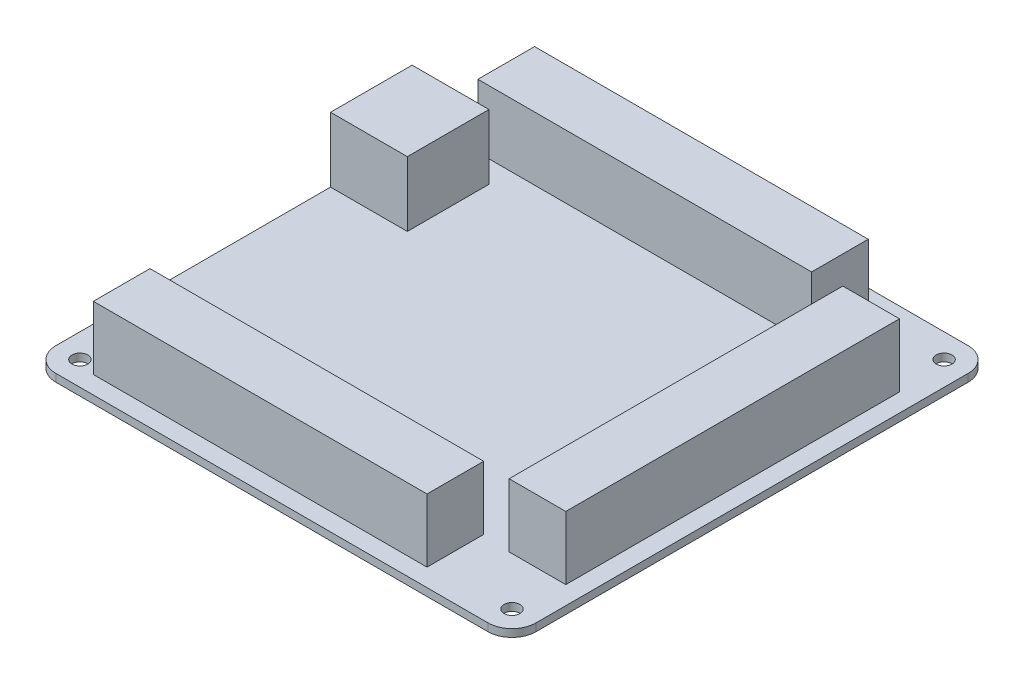
ISO-10303-21;
HEADER;
FILE_DESCRIPTION(('STEP AP214'),'2;1');
FILE_NAME('part.step','',(''),(''),'','','');
FILE_SCHEMA(('AUTOMOTIVE_DESIGN { 1 0 10303 214 1 1 1 1 }'));
ENDSEC;
DATA;
#1=APPLICATION_CONTEXT('core data for automotive mechanical design processes');
#2=APPLICATION_PROTOCOL_DEFINITION('international standard','automotive_design',2000,#1);
#3=PRODUCT_CONTEXT('',#1,'mechanical');
#4=PRODUCT('Part','Part','',(#3));
#5=PRODUCT_RELATED_PRODUCT_CATEGORY('part','',(#4));
#6=PRODUCT_DEFINITION_FORMATION('','',#4);
#7=PRODUCT_DEFINITION_CONTEXT('part definition',#1,'design');
#8=PRODUCT_DEFINITION('design','',#6,#7);
#9=PRODUCT_DEFINITION_SHAPE('','',#8);
#10=(LENGTH_UNIT() NAMED_UNIT(*) SI_UNIT(.MILLI.,.METRE.));
#11=(NAMED_UNIT(*) PLANE_ANGLE_UNIT() SI_UNIT($,.RADIAN.));
#12=(NAMED_UNIT(*) SI_UNIT($,.STERADIAN.) SOLID_ANGLE_UNIT());
#13=UNCERTAINTY_MEASURE_WITH_UNIT(LENGTH_MEASURE(1.E-05),#10,'distance_accuracy_value','');
#14=(GEOMETRIC_REPRESENTATION_CONTEXT(3) GLOBAL_UNCERTAINTY_ASSIGNED_CONTEXT((#13)) GLOBAL_UNIT_ASSIGNED_CONTEXT((#10,
#11,#12)) REPRESENTATION_CONTEXT('',''));
#15=CARTESIAN_POINT('',(0.,0.,0.));
#16=DIRECTION('',(0.,0.,1.));
#17=DIRECTION('',(1.,0.,0.));
#18=AXIS2_PLACEMENT_3D('',#15,#16,#17);
#19=CARTESIAN_POINT('',(0.,1.6,0.));
#20=DIRECTION('',(0.,-1.,0.));
#21=DIRECTION('',(0.,0.,-1.));
#22=AXIS2_PLACEMENT_3D('',#19,#20,#21);
#23=PLANE('',#22);
#24=DIRECTION('',(0.,0.,1.));
#25=VECTOR('',#24,1.);
#26=CARTESIAN_POINT('',(34.4,1.6,-34.5));
#27=LINE('',#26,#25);
#28=CARTESIAN_POINT('',(34.4,1.6,-34.5));
#29=VERTEX_POINT('',#28);
#30=CARTESIAN_POINT('',(34.4,1.6,35.));
#31=VERTEX_POINT('',#30);
#32=EDGE_CURVE('E216',#29,#31,#27,.T.);
#33=ORIENTED_EDGE('',*,*,#32,.F.);
#34=DIRECTION('',(-1.,0.,0.));
#35=VECTOR('',#34,1.);
#36=CARTESIAN_POINT('',(34.4,1.6,-34.5));
#37=LINE('',#36,#35);
#38=CARTESIAN_POINT('',(46.2,1.6,-34.5));
#39=VERTEX_POINT('',#38);
#40=EDGE_CURVE('E229',#39,#29,#37,.T.);
#41=ORIENTED_EDGE('',*,*,#40,.F.);
#42=DIRECTION('',(0.,0.,-1.));
#43=VECTOR('',#42,1.);
#44=CARTESIAN_POINT('',(46.2,1.6,-34.5));
#45=LINE('',#44,#43);
#46=CARTESIAN_POINT('',(46.2,1.6,35.));
#47=VERTEX_POINT('',#46);
#48=EDGE_CURVE('E238',#47,#39,#45,.T.);
#49=ORIENTED_EDGE('',*,*,#48,.F.);
#50=DIRECTION('',(1.,0.,0.));
#51=VECTOR('',#50,1.);
#52=CARTESIAN_POINT('',(34.4,1.6,35.));
#53=LINE('',#52,#51);
#54=EDGE_CURVE('E219',#31,#47,#53,.T.);
#55=ORIENTED_EDGE('',*,*,#54,.F.);
#56=EDGE_LOOP('',(#33,#41,#49,#55));
#57=FACE_BOUND('',#56,.T.);
#58=DIRECTION('',(-1.,0.,0.));
#59=VECTOR('',#58,1.);
#60=CARTESIAN_POINT('',(-50.,1.6,-29.2));
#61=LINE('',#60,#59);
#62=CARTESIAN_POINT('',(-34.,1.6,-29.2));
#63=VERTEX_POINT('',#62);
#64=CARTESIAN_POINT('',(-50.,1.6,-29.2));
#65=VERTEX_POINT('',#64);
#66=EDGE_CURVE('E292',#63,#65,#61,.T.);
#67=ORIENTED_EDGE('',*,*,#66,.F.);
#68=DIRECTION('',(0.,0.,-1.));
#69=VECTOR('',#68,1.);
#70=CARTESIAN_POINT('',(-34.,1.6,-29.2));
#71=LINE('',#70,#69);
#72=CARTESIAN_POINT('',(-34.,1.6,-12.2));
#73=VERTEX_POINT('',#72);
#74=EDGE_CURVE('E299',#73,#63,#71,.T.);
#75=ORIENTED_EDGE('',*,*,#74,.F.);
#76=DIRECTION('',(1.,0.,0.));
#77=VECTOR('',#76,1.);
#78=CARTESIAN_POINT('',(-34.,1.6,-12.2));
#79=LINE('',#78,#77);
#80=CARTESIAN_POINT('',(-50.,1.6,-12.2));
#81=VERTEX_POINT('',#80);
#82=EDGE_CURVE('E287',#81,#73,#79,.T.);
#83=ORIENTED_EDGE('',*,*,#82,.F.);
#84=DIRECTION('',(0.,0.,1.));
#85=VECTOR('',#84,1.);
#86=CARTESIAN_POINT('',(-50.,1.6,50.));
#87=LINE('',#86,#85);
#88=CARTESIAN_POINT('',(-50.,1.6,45.));
#89=VERTEX_POINT('',#88);
#90=EDGE_CURVE('E360',#81,#89,#87,.T.);
#91=ORIENTED_EDGE('',*,*,#90,.T.);
#92=CARTESIAN_POINT('',(-45.,1.6,45.));
#93=DIRECTION('',(0.,-1.,0.));
#94=DIRECTION('',(0.,0.,-1.));
#95=AXIS2_PLACEMENT_3D('',#92,#93,#94);
#96=CIRCLE('',#95,5.);
#97=CARTESIAN_POINT('',(-45.,1.6,50.));
#98=VERTEX_POINT('',#97);
#99=EDGE_CURVE('E384',#89,#98,#96,.F.);
#100=ORIENTED_EDGE('',*,*,#99,.T.);
#101=DIRECTION('',(1.,0.,0.));
#102=VECTOR('',#101,1.);
#103=CARTESIAN_POINT('',(-50.,1.6,50.));
#104=LINE('',#103,#102);
#105=CARTESIAN_POINT('',(45.,1.6,50.));
#106=VERTEX_POINT('',#105);
#107=EDGE_CURVE('E363',#98,#106,#104,.T.);
#108=ORIENTED_EDGE('',*,*,#107,.T.);
#109=CARTESIAN_POINT('',(45.,1.6,45.));
#110=DIRECTION('',(0.,-1.,0.));
#111=DIRECTION('',(0.,0.,-1.));
#112=AXIS2_PLACEMENT_3D('',#109,#110,#111);
#113=CIRCLE('',#112,5.);
#114=CARTESIAN_POINT('',(50.,1.6,45.));
#115=VERTEX_POINT('',#114);
#116=EDGE_CURVE('E382',#106,#115,#113,.F.);
#117=ORIENTED_EDGE('',*,*,#116,.T.);
#118=DIRECTION('',(0.,0.,-1.));
#119=VECTOR('',#118,1.);
#120=CARTESIAN_POINT('',(50.,1.6,50.));
#121=LINE('',#120,#119);
#122=CARTESIAN_POINT('',(50.,1.6,-45.));
#123=VERTEX_POINT('',#122);
#124=EDGE_CURVE('E353',#115,#123,#121,.T.);
#125=ORIENTED_EDGE('',*,*,#124,.T.);
#126=CARTESIAN_POINT('',(45.,1.6,-45.));
#127=DIRECTION('',(0.,-1.,0.));
#128=DIRECTION('',(0.,0.,-1.));
#129=AXIS2_PLACEMENT_3D('',#126,#127,#128);
#130=CIRCLE('',#129,5.);
#131=CARTESIAN_POINT('',(45.,1.6,-50.));
#132=VERTEX_POINT('',#131);
#133=EDGE_CURVE('E380',#123,#132,#130,.F.);
#134=ORIENTED_EDGE('',*,*,#133,.T.);
#135=DIRECTION('',(-1.,0.,0.));
#136=VECTOR('',#135,1.);
#137=CARTESIAN_POINT('',(-50.,1.6,-50.));
#138=LINE('',#137,#136);
#139=CARTESIAN_POINT('',(-45.,1.6,-50.));
#140=VERTEX_POINT('',#139);
#141=EDGE_CURVE('E356',#132,#140,#138,.T.);
#142=ORIENTED_EDGE('',*,*,#141,.T.);
#143=CARTESIAN_POINT('',(-45.,1.6,-45.));
#144=DIRECTION('',(0.,-1.,0.));
#145=DIRECTION('',(0.,0.,-1.));
#146=AXIS2_PLACEMENT_3D('',#143,#144,#145);
#147=CIRCLE('',#146,5.);
#148=CARTESIAN_POINT('',(-50.,1.6,-45.));
#149=VERTEX_POINT('',#148);
#150=EDGE_CURVE('E378',#140,#149,#147,.F.);
#151=ORIENTED_EDGE('',*,*,#150,.T.);
#152=EDGE_CURVE('E369',#149,#65,#87,.T.);
#153=ORIENTED_EDGE('',*,*,#152,.T.);
#154=EDGE_LOOP('',(#67,#75,#83,#91,#100,#108,#117,#125,#134,#142,#151,#153));
#155=FACE_BOUND('',#154,.T.);
#156=CARTESIAN_POINT('',(45.,1.6,45.));
#157=DIRECTION('',(0.,1.,0.));
#158=DIRECTION('',(0.,0.,1.));
#159=AXIS2_PLACEMENT_3D('',#156,#157,#158);
#160=CIRCLE('',#159,1.64999999999999);
#161=CARTESIAN_POINT('',(45.,1.6,46.65));
#162=VERTEX_POINT('',#161);
#163=EDGE_CURVE('E327',#162,#162,#160,.T.);
#164=ORIENTED_EDGE('',*,*,#163,.F.);
#165=EDGE_LOOP('',(#164));
#166=FACE_BOUND('',#165,.T.);
#167=CARTESIAN_POINT('',(-45.,1.6,45.));
#168=DIRECTION('',(0.,1.,0.));
#169=DIRECTION('',(0.,0.,1.));
#170=AXIS2_PLACEMENT_3D('',#167,#168,#169);
#171=CIRCLE('',#170,1.64999999999999);
#172=CARTESIAN_POINT('',(-45.,1.6,46.65));
#173=VERTEX_POINT('',#172);
#174=EDGE_CURVE('E334',#173,#173,#171,.T.);
#175=ORIENTED_EDGE('',*,*,#174,.F.);
#176=EDGE_LOOP('',(#175));
#177=FACE_BOUND('',#176,.T.);
#178=CARTESIAN_POINT('',(-45.,1.6,-45.));
#179=DIRECTION('',(0.,1.,0.));
#180=DIRECTION('',(0.,0.,1.));
#181=AXIS2_PLACEMENT_3D('',#178,#179,#180);
#182=CIRCLE('',#181,1.64999999999999);
#183=CARTESIAN_POINT('',(-45.,1.6,-43.35));
#184=VERTEX_POINT('',#183);
#185=EDGE_CURVE('E340',#184,#184,#182,.T.);
#186=ORIENTED_EDGE('',*,*,#185,.F.);
#187=EDGE_LOOP('',(#186));
#188=FACE_BOUND('',#187,.T.);
#189=CARTESIAN_POINT('',(45.,1.6,-45.));
#190=DIRECTION('',(0.,1.,0.));
#191=DIRECTION('',(0.,0.,1.));
#192=AXIS2_PLACEMENT_3D('',#189,#190,#191);
#193=CIRCLE('',#192,1.64999999999999);
#194=CARTESIAN_POINT('',(45.,1.6,-43.35));
#195=VERTEX_POINT('',#194);
#196=EDGE_CURVE('E346',#195,#195,#193,.T.);
#197=ORIENTED_EDGE('',*,*,#196,.F.);
#198=EDGE_LOOP('',(#197));
#199=FACE_BOUND('',#198,.T.);
#200=DIRECTION('',(0.,0.,1.));
#201=VECTOR('',#200,1.);
#202=CARTESIAN_POINT('',(-40.9,1.6,-45.6));
#203=LINE('',#202,#201);
#204=CARTESIAN_POINT('',(-40.9,1.6,-45.6));
#205=VERTEX_POINT('',#204);
#206=CARTESIAN_POINT('',(-40.9,1.6,-33.8));
#207=VERTEX_POINT('',#206);
#208=EDGE_CURVE('E254',#205,#207,#203,.T.);
#209=ORIENTED_EDGE('',*,*,#208,.F.);
#210=DIRECTION('',(-1.,0.,0.));
#211=VECTOR('',#210,1.);
#212=CARTESIAN_POINT('',(-40.9,1.6,-45.6));
#213=LINE('',#212,#211);
#214=CARTESIAN_POINT('',(28.6,1.6,-45.6));
#215=VERTEX_POINT('',#214);
#216=EDGE_CURVE('E259',#215,#205,#213,.T.);
#217=ORIENTED_EDGE('',*,*,#216,.F.);
#218=DIRECTION('',(0.,0.,-1.));
#219=VECTOR('',#218,1.);
#220=CARTESIAN_POINT('',(28.6,1.6,-45.6));
#221=LINE('',#220,#219);
#222=CARTESIAN_POINT('',(28.6,1.6,-33.8));
#223=VERTEX_POINT('',#222);
#224=EDGE_CURVE('E271',#223,#215,#221,.T.);
#225=ORIENTED_EDGE('',*,*,#224,.F.);
#226=DIRECTION('',(1.,0.,0.));
#227=VECTOR('',#226,1.);
#228=CARTESIAN_POINT('',(-40.9,1.6,-33.8));
#229=LINE('',#228,#227);
#230=EDGE_CURVE('E268',#207,#223,#229,.T.);
#231=ORIENTED_EDGE('',*,*,#230,.F.);
#232=EDGE_LOOP('',(#209,#217,#225,#231));
#233=FACE_BOUND('',#232,.T.);
#234=DIRECTION('',(0.,0.,1.));
#235=VECTOR('',#234,1.);
#236=CARTESIAN_POINT('',(-40.9,1.6,34.5));
#237=LINE('',#236,#235);
#238=CARTESIAN_POINT('',(-40.9,1.6,34.5));
#239=VERTEX_POINT('',#238);
#240=CARTESIAN_POINT('',(-40.9,1.6,46.3));
#241=VERTEX_POINT('',#240);
#242=EDGE_CURVE('E215',#239,#241,#237,.T.);
#243=ORIENTED_EDGE('',*,*,#242,.F.);
#244=DIRECTION('',(-1.,0.,0.));
#245=VECTOR('',#244,1.);
#246=CARTESIAN_POINT('',(-40.9,1.6,34.5));
#247=LINE('',#246,#245);
#248=CARTESIAN_POINT('',(28.6,1.6,34.5));
#249=VERTEX_POINT('',#248);
#250=EDGE_CURVE('E212',#249,#239,#247,.T.);
#251=ORIENTED_EDGE('',*,*,#250,.F.);
#252=DIRECTION('',(0.,0.,-1.));
#253=VECTOR('',#252,1.);
#254=CARTESIAN_POINT('',(28.6,1.6,34.5));
#255=LINE('',#254,#253);
#256=CARTESIAN_POINT('',(28.6,1.6,46.3));
#257=VERTEX_POINT('',#256);
#258=EDGE_CURVE('E55',#257,#249,#255,.T.);
#259=ORIENTED_EDGE('',*,*,#258,.F.);
#260=DIRECTION('',(1.,0.,0.));
#261=VECTOR('',#260,1.);
#262=CARTESIAN_POINT('',(-40.9,1.6,46.3));
#263=LINE('',#262,#261);
#264=EDGE_CURVE('E50',#241,#257,#263,.T.);
#265=ORIENTED_EDGE('',*,*,#264,.F.);
#266=EDGE_LOOP('',(#243,#251,#259,#265));
#267=FACE_BOUND('',#266,.T.);
#268=ADVANCED_FACE('F33',(#57,#155,#166,#177,#188,#199,#233,#267),#23,.F.);
#269=CARTESIAN_POINT('',(50.,1.6,50.));
#270=DIRECTION('',(-1.,0.,0.));
#271=DIRECTION('',(0.,0.,1.));
#272=AXIS2_PLACEMENT_3D('',#269,#270,#271);
#273=PLANE('',#272);
#274=DIRECTION('',(0.,0.,-1.));
#275=VECTOR('',#274,1.);
#276=CARTESIAN_POINT('',(50.,0.,50.));
#277=LINE('',#276,#275);
#278=CARTESIAN_POINT('',(50.,0.,45.));
#279=VERTEX_POINT('',#278);
#280=CARTESIAN_POINT('',(50.,0.,-45.));
#281=VERTEX_POINT('',#280);
#282=EDGE_CURVE('E352',#279,#281,#277,.T.);
#283=ORIENTED_EDGE('',*,*,#282,.T.);
#284=DIRECTION('',(0.,-1.,0.));
#285=VECTOR('',#284,1.);
#286=CARTESIAN_POINT('',(50.,1.6,-45.));
#287=LINE('',#286,#285);
#288=EDGE_CURVE('E373',#281,#123,#287,.F.);
#289=ORIENTED_EDGE('',*,*,#288,.T.);
#290=ORIENTED_EDGE('',*,*,#124,.F.);
#291=DIRECTION('',(0.,-1.,0.));
#292=VECTOR('',#291,1.);
#293=CARTESIAN_POINT('',(50.,1.6,45.));
#294=LINE('',#293,#292);
#295=EDGE_CURVE('E375',#115,#279,#294,.T.);
#296=ORIENTED_EDGE('',*,*,#295,.T.);
#297=EDGE_LOOP('',(#283,#289,#290,#296));
#298=FACE_BOUND('',#297,.T.);
#299=ADVANCED_FACE('F416',(#298),#273,.F.);
#300=CARTESIAN_POINT('',(-50.,1.6,-50.));
#301=DIRECTION('',(0.,0.,1.));
#302=DIRECTION('',(1.,0.,0.));
#303=AXIS2_PLACEMENT_3D('',#300,#301,#302);
#304=PLANE('',#303);
#305=DIRECTION('',(-1.,0.,0.));
#306=VECTOR('',#305,1.);
#307=CARTESIAN_POINT('',(-50.,0.,-50.));
#308=LINE('',#307,#306);
#309=CARTESIAN_POINT('',(45.,0.,-50.));
#310=VERTEX_POINT('',#309);
#311=CARTESIAN_POINT('',(-45.,0.,-50.));
#312=VERTEX_POINT('',#311);
#313=EDGE_CURVE('E410',#310,#312,#308,.T.);
#314=ORIENTED_EDGE('',*,*,#313,.T.);
#315=DIRECTION('',(0.,-1.,0.));
#316=VECTOR('',#315,1.);
#317=CARTESIAN_POINT('',(-45.,1.6,-50.));
#318=LINE('',#317,#316);
#319=EDGE_CURVE('E386',#312,#140,#318,.F.);
#320=ORIENTED_EDGE('',*,*,#319,.T.);
#321=ORIENTED_EDGE('',*,*,#141,.F.);
#322=DIRECTION('',(0.,-1.,0.));
#323=VECTOR('',#322,1.);
#324=CARTESIAN_POINT('',(45.,1.6,-50.));
#325=LINE('',#324,#323);
#326=EDGE_CURVE('E388',#132,#310,#325,.T.);
#327=ORIENTED_EDGE('',*,*,#326,.T.);
#328=EDGE_LOOP('',(#314,#320,#321,#327));
#329=FACE_BOUND('',#328,.T.);
#330=ADVANCED_FACE('F429',(#329),#304,.F.);
#331=CARTESIAN_POINT('',(-50.,1.6,50.));
#332=DIRECTION('',(1.,0.,0.));
#333=DIRECTION('',(0.,0.,-1.));
#334=AXIS2_PLACEMENT_3D('',#331,#332,#333);
#335=PLANE('',#334);
#336=ORIENTED_EDGE('',*,*,#152,.F.);
#337=DIRECTION('',(0.,-1.,0.));
#338=VECTOR('',#337,1.);
#339=CARTESIAN_POINT('',(-50.,1.6,-45.));
#340=LINE('',#339,#338);
#341=CARTESIAN_POINT('',(-50.,0.,-45.));
#342=VERTEX_POINT('',#341);
#343=EDGE_CURVE('E399',#149,#342,#340,.T.);
#344=ORIENTED_EDGE('',*,*,#343,.T.);
#345=DIRECTION('',(0.,0.,1.));
#346=VECTOR('',#345,1.);
#347=CARTESIAN_POINT('',(-50.,0.,50.));
#348=LINE('',#347,#346);
#349=CARTESIAN_POINT('',(-50.,0.,45.));
#350=VERTEX_POINT('',#349);
#351=EDGE_CURVE('E407',#342,#350,#348,.T.);
#352=ORIENTED_EDGE('',*,*,#351,.T.);
#353=DIRECTION('',(0.,-1.,0.));
#354=VECTOR('',#353,1.);
#355=CARTESIAN_POINT('',(-50.,1.6,45.));
#356=LINE('',#355,#354);
#357=EDGE_CURVE('E402',#350,#89,#356,.F.);
#358=ORIENTED_EDGE('',*,*,#357,.T.);
#359=ORIENTED_EDGE('',*,*,#90,.F.);
#360=DIRECTION('',(0.,-1.,0.));
#361=VECTOR('',#360,1.);
#362=CARTESIAN_POINT('',(-50.,15.1,-12.2));
#363=LINE('',#362,#361);
#364=CARTESIAN_POINT('',(-50.,15.1,-12.2));
#365=VERTEX_POINT('',#364);
#366=EDGE_CURVE('E322',#365,#81,#363,.T.);
#367=ORIENTED_EDGE('',*,*,#366,.F.);
#368=DIRECTION('',(0.,0.,1.));
#369=VECTOR('',#368,1.);
#370=CARTESIAN_POINT('',(-50.,15.1,-29.2));
#371=LINE('',#370,#369);
#372=CARTESIAN_POINT('',(-50.,15.1,-29.2));
#373=VERTEX_POINT('',#372);
#374=EDGE_CURVE('E288',#373,#365,#371,.T.);
#375=ORIENTED_EDGE('',*,*,#374,.F.);
#376=DIRECTION('',(0.,-1.,0.));
#377=VECTOR('',#376,1.);
#378=CARTESIAN_POINT('',(-50.,15.1,-29.2));
#379=LINE('',#378,#377);
#380=EDGE_CURVE('E298',#373,#65,#379,.T.);
#381=ORIENTED_EDGE('',*,*,#380,.T.);
#382=EDGE_LOOP('',(#336,#344,#352,#358,#359,#367,#375,#381));
#383=FACE_BOUND('',#382,.T.);
#384=ADVANCED_FACE('F435',(#383),#335,.F.);
#385=CARTESIAN_POINT('',(-50.,1.6,50.));
#386=DIRECTION('',(0.,0.,-1.));
#387=DIRECTION('',(-1.,0.,0.));
#388=AXIS2_PLACEMENT_3D('',#385,#386,#387);
#389=PLANE('',#388);
#390=DIRECTION('',(1.,0.,0.));
#391=VECTOR('',#390,1.);
#392=CARTESIAN_POINT('',(-50.,0.,50.));
#393=LINE('',#392,#391);
#394=CARTESIAN_POINT('',(-45.,0.,50.));
#395=VERTEX_POINT('',#394);
#396=CARTESIAN_POINT('',(45.,0.,50.));
#397=VERTEX_POINT('',#396);
#398=EDGE_CURVE('E357',#395,#397,#393,.T.);
#399=ORIENTED_EDGE('',*,*,#398,.T.);
#400=DIRECTION('',(0.,-1.,0.));
#401=VECTOR('',#400,1.);
#402=CARTESIAN_POINT('',(45.,1.6,50.));
#403=LINE('',#402,#401);
#404=EDGE_CURVE('E11',#397,#106,#403,.F.);
#405=ORIENTED_EDGE('',*,*,#404,.T.);
#406=ORIENTED_EDGE('',*,*,#107,.F.);
#407=DIRECTION('',(0.,-1.,0.));
#408=VECTOR('',#407,1.);
#409=CARTESIAN_POINT('',(-45.,1.6,50.));
#410=LINE('',#409,#408);
#411=EDGE_CURVE('E42',#98,#395,#410,.T.);
#412=ORIENTED_EDGE('',*,*,#411,.T.);
#413=EDGE_LOOP('',(#399,#405,#406,#412));
#414=FACE_BOUND('',#413,.T.);
#415=ADVANCED_FACE('F445',(#414),#389,.F.);
#416=CARTESIAN_POINT('',(0.,0.,0.));
#417=DIRECTION('',(0.,-1.,0.));
#418=DIRECTION('',(0.,0.,-1.));
#419=AXIS2_PLACEMENT_3D('',#416,#417,#418);
#420=PLANE('',#419);
#421=CARTESIAN_POINT('',(45.,0.,45.));
#422=DIRECTION('',(0.,1.,0.));
#423=DIRECTION('',(0.,0.,1.));
#424=AXIS2_PLACEMENT_3D('',#421,#422,#423);
#425=CIRCLE('',#424,1.64999999999999);
#426=CARTESIAN_POINT('',(45.,0.,46.65));
#427=VERTEX_POINT('',#426);
#428=EDGE_CURVE('E331',#427,#427,#425,.T.);
#429=ORIENTED_EDGE('',*,*,#428,.T.);
#430=EDGE_LOOP('',(#429));
#431=FACE_BOUND('',#430,.T.);
#432=CARTESIAN_POINT('',(-45.,0.,45.));
#433=DIRECTION('',(0.,1.,0.));
#434=DIRECTION('',(0.,0.,1.));
#435=AXIS2_PLACEMENT_3D('',#432,#433,#434);
#436=CIRCLE('',#435,1.64999999999999);
#437=CARTESIAN_POINT('',(-45.,0.,46.65));
#438=VERTEX_POINT('',#437);
#439=EDGE_CURVE('E337',#438,#438,#436,.T.);
#440=ORIENTED_EDGE('',*,*,#439,.T.);
#441=EDGE_LOOP('',(#440));
#442=FACE_BOUND('',#441,.T.);
#443=CARTESIAN_POINT('',(-45.,0.,-45.));
#444=DIRECTION('',(0.,1.,0.));
#445=DIRECTION('',(0.,0.,1.));
#446=AXIS2_PLACEMENT_3D('',#443,#444,#445);
#447=CIRCLE('',#446,1.64999999999999);
#448=CARTESIAN_POINT('',(-45.,0.,-43.35));
#449=VERTEX_POINT('',#448);
#450=EDGE_CURVE('E343',#449,#449,#447,.T.);
#451=ORIENTED_EDGE('',*,*,#450,.T.);
#452=EDGE_LOOP('',(#451));
#453=FACE_BOUND('',#452,.T.);
#454=CARTESIAN_POINT('',(45.,0.,-45.));
#455=DIRECTION('',(0.,1.,0.));
#456=DIRECTION('',(0.,0.,1.));
#457=AXIS2_PLACEMENT_3D('',#454,#455,#456);
#458=CIRCLE('',#457,1.64999999999999);
#459=CARTESIAN_POINT('',(45.,0.,-43.35));
#460=VERTEX_POINT('',#459);
#461=EDGE_CURVE('E349',#460,#460,#458,.T.);
#462=ORIENTED_EDGE('',*,*,#461,.T.);
#463=EDGE_LOOP('',(#462));
#464=FACE_BOUND('',#463,.T.);
#465=ORIENTED_EDGE('',*,*,#351,.F.);
#466=CARTESIAN_POINT('',(-45.,0.,-45.));
#467=DIRECTION('',(0.,-1.,0.));
#468=DIRECTION('',(0.,0.,-1.));
#469=AXIS2_PLACEMENT_3D('',#466,#467,#468);
#470=CIRCLE('',#469,5.);
#471=EDGE_CURVE('E391',#342,#312,#470,.T.);
#472=ORIENTED_EDGE('',*,*,#471,.T.);
#473=ORIENTED_EDGE('',*,*,#313,.F.);
#474=CARTESIAN_POINT('',(45.,0.,-45.));
#475=DIRECTION('',(0.,-1.,0.));
#476=DIRECTION('',(0.,0.,-1.));
#477=AXIS2_PLACEMENT_3D('',#474,#475,#476);
#478=CIRCLE('',#477,5.);
#479=EDGE_CURVE('E393',#310,#281,#478,.T.);
#480=ORIENTED_EDGE('',*,*,#479,.T.);
#481=ORIENTED_EDGE('',*,*,#282,.F.);
#482=CARTESIAN_POINT('',(45.,0.,45.));
#483=DIRECTION('',(0.,-1.,0.));
#484=DIRECTION('',(0.,0.,-1.));
#485=AXIS2_PLACEMENT_3D('',#482,#483,#484);
#486=CIRCLE('',#485,5.);
#487=EDGE_CURVE('E395',#279,#397,#486,.T.);
#488=ORIENTED_EDGE('',*,*,#487,.T.);
#489=ORIENTED_EDGE('',*,*,#398,.F.);
#490=CARTESIAN_POINT('',(-45.,0.,45.));
#491=DIRECTION('',(0.,-1.,0.));
#492=DIRECTION('',(0.,0.,-1.));
#493=AXIS2_PLACEMENT_3D('',#490,#491,#492);
#494=CIRCLE('',#493,5.);
#495=EDGE_CURVE('E397',#395,#350,#494,.T.);
#496=ORIENTED_EDGE('',*,*,#495,.T.);
#497=EDGE_LOOP('',(#465,#472,#473,#480,#481,#488,#489,#496));
#498=FACE_BOUND('',#497,.T.);
#499=ADVANCED_FACE('F438',(#431,#442,#453,#464,#498),#420,.T.);
#500=CARTESIAN_POINT('',(-45.,1.6,-45.));
#501=DIRECTION('',(0.,-1.,0.));
#502=DIRECTION('',(0.,0.,-1.));
#503=AXIS2_PLACEMENT_3D('',#500,#501,#502);
#504=CYLINDRICAL_SURFACE('',#503,5.);
#505=ORIENTED_EDGE('',*,*,#150,.F.);
#506=ORIENTED_EDGE('',*,*,#319,.F.);
#507=ORIENTED_EDGE('',*,*,#471,.F.);
#508=ORIENTED_EDGE('',*,*,#343,.F.);
#509=EDGE_LOOP('',(#505,#506,#507,#508));
#510=FACE_BOUND('',#509,.T.);
#511=ADVANCED_FACE('F433',(#510),#504,.T.);
#512=CARTESIAN_POINT('',(45.,1.6,-45.));
#513=DIRECTION('',(0.,-1.,0.));
#514=DIRECTION('',(0.,0.,-1.));
#515=AXIS2_PLACEMENT_3D('',#512,#513,#514);
#516=CYLINDRICAL_SURFACE('',#515,5.);
#517=ORIENTED_EDGE('',*,*,#133,.F.);
#518=ORIENTED_EDGE('',*,*,#288,.F.);
#519=ORIENTED_EDGE('',*,*,#479,.F.);
#520=ORIENTED_EDGE('',*,*,#326,.F.);
#521=EDGE_LOOP('',(#517,#518,#519,#520));
#522=FACE_BOUND('',#521,.T.);
#523=ADVANCED_FACE('F422',(#522),#516,.T.);
#524=CARTESIAN_POINT('',(45.,1.6,45.));
#525=DIRECTION('',(0.,-1.,0.));
#526=DIRECTION('',(0.,0.,-1.));
#527=AXIS2_PLACEMENT_3D('',#524,#525,#526);
#528=CYLINDRICAL_SURFACE('',#527,5.);
#529=ORIENTED_EDGE('',*,*,#116,.F.);
#530=ORIENTED_EDGE('',*,*,#404,.F.);
#531=ORIENTED_EDGE('',*,*,#487,.F.);
#532=ORIENTED_EDGE('',*,*,#295,.F.);
#533=EDGE_LOOP('',(#529,#530,#531,#532));
#534=FACE_BOUND('',#533,.T.);
#535=ADVANCED_FACE('F450',(#534),#528,.T.);
#536=CARTESIAN_POINT('',(-45.,1.6,45.));
#537=DIRECTION('',(0.,-1.,0.));
#538=DIRECTION('',(0.,0.,-1.));
#539=AXIS2_PLACEMENT_3D('',#536,#537,#538);
#540=CYLINDRICAL_SURFACE('',#539,5.);
#541=ORIENTED_EDGE('',*,*,#99,.F.);
#542=ORIENTED_EDGE('',*,*,#357,.F.);
#543=ORIENTED_EDGE('',*,*,#495,.F.);
#544=ORIENTED_EDGE('',*,*,#411,.F.);
#545=EDGE_LOOP('',(#541,#542,#543,#544));
#546=FACE_BOUND('',#545,.T.);
#547=ADVANCED_FACE('F35',(#546),#540,.T.);
#548=CARTESIAN_POINT('',(45.,1.6,-45.));
#549=DIRECTION('',(0.,1.,0.));
#550=DIRECTION('',(0.,0.,1.));
#551=AXIS2_PLACEMENT_3D('',#548,#549,#550);
#552=CYLINDRICAL_SURFACE('',#551,1.64999999999999);
#553=ORIENTED_EDGE('',*,*,#461,.F.);
#554=EDGE_LOOP('',(#553));
#555=FACE_BOUND('',#554,.T.);
#556=ORIENTED_EDGE('',*,*,#196,.T.);
#557=EDGE_LOOP('',(#556));
#558=FACE_BOUND('',#557,.T.);
#559=ADVANCED_FACE('F456',(#555,#558),#552,.F.);
#560=CARTESIAN_POINT('',(-45.,1.6,-45.));
#561=DIRECTION('',(0.,1.,0.));
#562=DIRECTION('',(0.,0.,1.));
#563=AXIS2_PLACEMENT_3D('',#560,#561,#562);
#564=CYLINDRICAL_SURFACE('',#563,1.64999999999999);
#565=ORIENTED_EDGE('',*,*,#450,.F.);
#566=EDGE_LOOP('',(#565));
#567=FACE_BOUND('',#566,.T.);
#568=ORIENTED_EDGE('',*,*,#185,.T.);
#569=EDGE_LOOP('',(#568));
#570=FACE_BOUND('',#569,.T.);
#571=ADVANCED_FACE('F511',(#567,#570),#564,.F.);
#572=CARTESIAN_POINT('',(-45.,1.6,45.));
#573=DIRECTION('',(0.,1.,0.));
#574=DIRECTION('',(0.,0.,1.));
#575=AXIS2_PLACEMENT_3D('',#572,#573,#574);
#576=CYLINDRICAL_SURFACE('',#575,1.64999999999999);
#577=ORIENTED_EDGE('',*,*,#439,.F.);
#578=EDGE_LOOP('',(#577));
#579=FACE_BOUND('',#578,.T.);
#580=ORIENTED_EDGE('',*,*,#174,.T.);
#581=EDGE_LOOP('',(#580));
#582=FACE_BOUND('',#581,.T.);
#583=ADVANCED_FACE('F520',(#579,#582),#576,.F.);
#584=CARTESIAN_POINT('',(45.,1.6,45.));
#585=DIRECTION('',(0.,1.,0.));
#586=DIRECTION('',(0.,0.,1.));
#587=AXIS2_PLACEMENT_3D('',#584,#585,#586);
#588=CYLINDRICAL_SURFACE('',#587,1.64999999999999);
#589=ORIENTED_EDGE('',*,*,#428,.F.);
#590=EDGE_LOOP('',(#589));
#591=FACE_BOUND('',#590,.T.);
#592=ORIENTED_EDGE('',*,*,#163,.T.);
#593=EDGE_LOOP('',(#592));
#594=FACE_BOUND('',#593,.T.);
#595=ADVANCED_FACE('F529',(#591,#594),#588,.F.);
#596=CARTESIAN_POINT('',(-34.,15.1,-12.2));
#597=DIRECTION('',(0.,0.,-1.));
#598=DIRECTION('',(-1.,0.,0.));
#599=AXIS2_PLACEMENT_3D('',#596,#597,#598);
#600=PLANE('',#599);
#601=ORIENTED_EDGE('',*,*,#82,.T.);
#602=DIRECTION('',(0.,-1.,0.));
#603=VECTOR('',#602,1.);
#604=CARTESIAN_POINT('',(-34.,15.1,-12.2));
#605=LINE('',#604,#603);
#606=CARTESIAN_POINT('',(-34.,15.1,-12.2));
#607=VERTEX_POINT('',#606);
#608=EDGE_CURVE('E317',#607,#73,#605,.T.);
#609=ORIENTED_EDGE('',*,*,#608,.F.);
#610=DIRECTION('',(1.,0.,0.));
#611=VECTOR('',#610,1.);
#612=CARTESIAN_POINT('',(-34.,15.1,-12.2));
#613=LINE('',#612,#611);
#614=EDGE_CURVE('E291',#365,#607,#613,.T.);
#615=ORIENTED_EDGE('',*,*,#614,.F.);
#616=ORIENTED_EDGE('',*,*,#366,.T.);
#617=EDGE_LOOP('',(#601,#609,#615,#616));
#618=FACE_BOUND('',#617,.T.);
#619=ADVANCED_FACE('F539',(#618),#600,.F.);
#620=CARTESIAN_POINT('',(-34.,15.1,-29.2));
#621=DIRECTION('',(-1.,0.,0.));
#622=DIRECTION('',(0.,0.,1.));
#623=AXIS2_PLACEMENT_3D('',#620,#621,#622);
#624=PLANE('',#623);
#625=ORIENTED_EDGE('',*,*,#74,.T.);
#626=DIRECTION('',(0.,-1.,0.));
#627=VECTOR('',#626,1.);
#628=CARTESIAN_POINT('',(-34.,15.1,-29.2));
#629=LINE('',#628,#627);
#630=CARTESIAN_POINT('',(-34.,15.1,-29.2));
#631=VERTEX_POINT('',#630);
#632=EDGE_CURVE('E304',#631,#63,#629,.T.);
#633=ORIENTED_EDGE('',*,*,#632,.F.);
#634=DIRECTION('',(0.,0.,-1.));
#635=VECTOR('',#634,1.);
#636=CARTESIAN_POINT('',(-34.,15.1,-29.2));
#637=LINE('',#636,#635);
#638=EDGE_CURVE('E294',#607,#631,#637,.T.);
#639=ORIENTED_EDGE('',*,*,#638,.F.);
#640=ORIENTED_EDGE('',*,*,#608,.T.);
#641=EDGE_LOOP('',(#625,#633,#639,#640));
#642=FACE_BOUND('',#641,.T.);
#643=ADVANCED_FACE('F556',(#642),#624,.F.);
#644=CARTESIAN_POINT('',(-50.,15.1,-29.2));
#645=DIRECTION('',(0.,0.,1.));
#646=DIRECTION('',(1.,0.,0.));
#647=AXIS2_PLACEMENT_3D('',#644,#645,#646);
#648=PLANE('',#647);
#649=ORIENTED_EDGE('',*,*,#66,.T.);
#650=ORIENTED_EDGE('',*,*,#380,.F.);
#651=DIRECTION('',(-1.,0.,0.));
#652=VECTOR('',#651,1.);
#653=CARTESIAN_POINT('',(-50.,15.1,-29.2));
#654=LINE('',#653,#652);
#655=EDGE_CURVE('E296',#631,#373,#654,.T.);
#656=ORIENTED_EDGE('',*,*,#655,.F.);
#657=ORIENTED_EDGE('',*,*,#632,.T.);
#658=EDGE_LOOP('',(#649,#650,#656,#657));
#659=FACE_BOUND('',#658,.T.);
#660=ADVANCED_FACE('F566',(#659),#648,.F.);
#661=CARTESIAN_POINT('',(0.,15.1,0.));
#662=DIRECTION('',(0.,-1.,0.));
#663=DIRECTION('',(0.,0.,-1.));
#664=AXIS2_PLACEMENT_3D('',#661,#662,#663);
#665=PLANE('',#664);
#666=ORIENTED_EDGE('',*,*,#374,.T.);
#667=ORIENTED_EDGE('',*,*,#614,.T.);
#668=ORIENTED_EDGE('',*,*,#638,.T.);
#669=ORIENTED_EDGE('',*,*,#655,.T.);
#670=EDGE_LOOP('',(#666,#667,#668,#669));
#671=FACE_BOUND('',#670,.T.);
#672=ADVANCED_FACE('F575',(#671),#665,.F.);
#673=CARTESIAN_POINT('',(-40.9,14.8,-45.6));
#674=DIRECTION('',(1.,0.,0.));
#675=DIRECTION('',(0.,0.,-1.));
#676=AXIS2_PLACEMENT_3D('',#673,#674,#675);
#677=PLANE('',#676);
#678=ORIENTED_EDGE('',*,*,#208,.T.);
#679=DIRECTION('',(0.,-1.,0.));
#680=VECTOR('',#679,1.);
#681=CARTESIAN_POINT('',(-40.9,14.8,-33.8));
#682=LINE('',#681,#680);
#683=CARTESIAN_POINT('',(-40.9,14.8,-33.8));
#684=VERTEX_POINT('',#683);
#685=EDGE_CURVE('E284',#684,#207,#682,.T.);
#686=ORIENTED_EDGE('',*,*,#685,.F.);
#687=DIRECTION('',(0.,0.,1.));
#688=VECTOR('',#687,1.);
#689=CARTESIAN_POINT('',(-40.9,14.8,-45.6));
#690=LINE('',#689,#688);
#691=CARTESIAN_POINT('',(-40.9,14.8,-45.6));
#692=VERTEX_POINT('',#691);
#693=EDGE_CURVE('E255',#692,#684,#690,.T.);
#694=ORIENTED_EDGE('',*,*,#693,.F.);
#695=DIRECTION('',(0.,-1.,0.));
#696=VECTOR('',#695,1.);
#697=CARTESIAN_POINT('',(-40.9,14.8,-45.6));
#698=LINE('',#697,#696);
#699=EDGE_CURVE('E265',#692,#205,#698,.T.);
#700=ORIENTED_EDGE('',*,*,#699,.T.);
#701=EDGE_LOOP('',(#678,#686,#694,#700));
#702=FACE_BOUND('',#701,.T.);
#703=ADVANCED_FACE('F583',(#702),#677,.F.);
#704=CARTESIAN_POINT('',(-40.9,14.8,-33.8));
#705=DIRECTION('',(0.,0.,-1.));
#706=DIRECTION('',(-1.,0.,0.));
#707=AXIS2_PLACEMENT_3D('',#704,#705,#706);
#708=PLANE('',#707);
#709=ORIENTED_EDGE('',*,*,#230,.T.);
#710=DIRECTION('',(0.,-1.,0.));
#711=VECTOR('',#710,1.);
#712=CARTESIAN_POINT('',(28.6,14.8,-33.8));
#713=LINE('',#712,#711);
#714=CARTESIAN_POINT('',(28.6,14.8,-33.8));
#715=VERTEX_POINT('',#714);
#716=EDGE_CURVE('E281',#715,#223,#713,.T.);
#717=ORIENTED_EDGE('',*,*,#716,.F.);
#718=DIRECTION('',(1.,0.,0.));
#719=VECTOR('',#718,1.);
#720=CARTESIAN_POINT('',(-40.9,14.8,-33.8));
#721=LINE('',#720,#719);
#722=EDGE_CURVE('E258',#684,#715,#721,.T.);
#723=ORIENTED_EDGE('',*,*,#722,.F.);
#724=ORIENTED_EDGE('',*,*,#685,.T.);
#725=EDGE_LOOP('',(#709,#717,#723,#724));
#726=FACE_BOUND('',#725,.T.);
#727=ADVANCED_FACE('F598',(#726),#708,.F.);
#728=CARTESIAN_POINT('',(28.6,14.8,-45.6));
#729=DIRECTION('',(-1.,0.,0.));
#730=DIRECTION('',(0.,0.,1.));
#731=AXIS2_PLACEMENT_3D('',#728,#729,#730);
#732=PLANE('',#731);
#733=ORIENTED_EDGE('',*,*,#224,.T.);
#734=DIRECTION('',(0.,-1.,0.));
#735=VECTOR('',#734,1.);
#736=CARTESIAN_POINT('',(28.6,14.8,-45.6));
#737=LINE('',#736,#735);
#738=CARTESIAN_POINT('',(28.6,14.8,-45.6));
#739=VERTEX_POINT('',#738);
#740=EDGE_CURVE('E278',#739,#215,#737,.T.);
#741=ORIENTED_EDGE('',*,*,#740,.F.);
#742=DIRECTION('',(0.,0.,-1.));
#743=VECTOR('',#742,1.);
#744=CARTESIAN_POINT('',(28.6,14.8,-45.6));
#745=LINE('',#744,#743);
#746=EDGE_CURVE('E261',#715,#739,#745,.T.);
#747=ORIENTED_EDGE('',*,*,#746,.F.);
#748=ORIENTED_EDGE('',*,*,#716,.T.);
#749=EDGE_LOOP('',(#733,#741,#747,#748));
#750=FACE_BOUND('',#749,.T.);
#751=ADVANCED_FACE('F608',(#750),#732,.F.);
#752=CARTESIAN_POINT('',(-40.9,14.8,-45.6));
#753=DIRECTION('',(0.,0.,1.));
#754=DIRECTION('',(1.,0.,0.));
#755=AXIS2_PLACEMENT_3D('',#752,#753,#754);
#756=PLANE('',#755);
#757=ORIENTED_EDGE('',*,*,#216,.T.);
#758=ORIENTED_EDGE('',*,*,#699,.F.);
#759=DIRECTION('',(-1.,0.,0.));
#760=VECTOR('',#759,1.);
#761=CARTESIAN_POINT('',(-40.9,14.8,-45.6));
#762=LINE('',#761,#760);
#763=EDGE_CURVE('E263',#739,#692,#762,.T.);
#764=ORIENTED_EDGE('',*,*,#763,.F.);
#765=ORIENTED_EDGE('',*,*,#740,.T.);
#766=EDGE_LOOP('',(#757,#758,#764,#765));
#767=FACE_BOUND('',#766,.T.);
#768=ADVANCED_FACE('F618',(#767),#756,.F.);
#769=CARTESIAN_POINT('',(0.,14.8,0.));
#770=DIRECTION('',(0.,1.,0.));
#771=DIRECTION('',(0.,0.,1.));
#772=AXIS2_PLACEMENT_3D('',#769,#770,#771);
#773=PLANE('',#772);
#774=ORIENTED_EDGE('',*,*,#693,.T.);
#775=ORIENTED_EDGE('',*,*,#722,.T.);
#776=ORIENTED_EDGE('',*,*,#746,.T.);
#777=ORIENTED_EDGE('',*,*,#763,.T.);
#778=EDGE_LOOP('',(#774,#775,#776,#777));
#779=FACE_BOUND('',#778,.T.);
#780=ADVANCED_FACE('F628',(#779),#773,.T.);
#781=CARTESIAN_POINT('',(34.4,14.8,-34.5));
#782=DIRECTION('',(1.,0.,0.));
#783=DIRECTION('',(0.,0.,-1.));
#784=AXIS2_PLACEMENT_3D('',#781,#782,#783);
#785=PLANE('',#784);
#786=ORIENTED_EDGE('',*,*,#32,.T.);
#787=DIRECTION('',(0.,-1.,0.));
#788=VECTOR('',#787,1.);
#789=CARTESIAN_POINT('',(34.4,14.8,35.));
#790=LINE('',#789,#788);
#791=CARTESIAN_POINT('',(34.4,14.8,35.));
#792=VERTEX_POINT('',#791);
#793=EDGE_CURVE('E251',#792,#31,#790,.T.);
#794=ORIENTED_EDGE('',*,*,#793,.F.);
#795=DIRECTION('',(0.,0.,1.));
#796=VECTOR('',#795,1.);
#797=CARTESIAN_POINT('',(34.4,14.8,-34.5));
#798=LINE('',#797,#796);
#799=CARTESIAN_POINT('',(34.4,14.8,-34.5));
#800=VERTEX_POINT('',#799);
#801=EDGE_CURVE('E225',#800,#792,#798,.T.);
#802=ORIENTED_EDGE('',*,*,#801,.F.);
#803=DIRECTION('',(0.,-1.,0.));
#804=VECTOR('',#803,1.);
#805=CARTESIAN_POINT('',(34.4,14.8,-34.5));
#806=LINE('',#805,#804);
#807=EDGE_CURVE('E234',#800,#29,#806,.T.);
#808=ORIENTED_EDGE('',*,*,#807,.T.);
#809=EDGE_LOOP('',(#786,#794,#802,#808));
#810=FACE_BOUND('',#809,.T.);
#811=ADVANCED_FACE('F638',(#810),#785,.F.);
#812=CARTESIAN_POINT('',(34.4,14.8,35.));
#813=DIRECTION('',(0.,0.,-1.));
#814=DIRECTION('',(-1.,0.,0.));
#815=AXIS2_PLACEMENT_3D('',#812,#813,#814);
#816=PLANE('',#815);
#817=ORIENTED_EDGE('',*,*,#54,.T.);
#818=DIRECTION('',(0.,-1.,0.));
#819=VECTOR('',#818,1.);
#820=CARTESIAN_POINT('',(46.2,14.8,35.));
#821=LINE('',#820,#819);
#822=CARTESIAN_POINT('',(46.2,14.8,35.));
#823=VERTEX_POINT('',#822);
#824=EDGE_CURVE('E248',#823,#47,#821,.T.);
#825=ORIENTED_EDGE('',*,*,#824,.F.);
#826=DIRECTION('',(1.,0.,0.));
#827=VECTOR('',#826,1.);
#828=CARTESIAN_POINT('',(34.4,14.8,35.));
#829=LINE('',#828,#827);
#830=EDGE_CURVE('E228',#792,#823,#829,.T.);
#831=ORIENTED_EDGE('',*,*,#830,.F.);
#832=ORIENTED_EDGE('',*,*,#793,.T.);
#833=EDGE_LOOP('',(#817,#825,#831,#832));
#834=FACE_BOUND('',#833,.T.);
#835=ADVANCED_FACE('F648',(#834),#816,.F.);
#836=CARTESIAN_POINT('',(46.2,14.8,-34.5));
#837=DIRECTION('',(-1.,0.,0.));
#838=DIRECTION('',(0.,0.,1.));
#839=AXIS2_PLACEMENT_3D('',#836,#837,#838);
#840=PLANE('',#839);
#841=ORIENTED_EDGE('',*,*,#48,.T.);
#842=DIRECTION('',(0.,-1.,0.));
#843=VECTOR('',#842,1.);
#844=CARTESIAN_POINT('',(46.2,14.8,-34.5));
#845=LINE('',#844,#843);
#846=CARTESIAN_POINT('',(46.2,14.8,-34.5));
#847=VERTEX_POINT('',#846);
#848=EDGE_CURVE('E245',#847,#39,#845,.T.);
#849=ORIENTED_EDGE('',*,*,#848,.F.);
#850=DIRECTION('',(0.,0.,-1.));
#851=VECTOR('',#850,1.);
#852=CARTESIAN_POINT('',(46.2,14.8,-34.5));
#853=LINE('',#852,#851);
#854=EDGE_CURVE('E231',#823,#847,#853,.T.);
#855=ORIENTED_EDGE('',*,*,#854,.F.);
#856=ORIENTED_EDGE('',*,*,#824,.T.);
#857=EDGE_LOOP('',(#841,#849,#855,#856));
#858=FACE_BOUND('',#857,.T.);
#859=ADVANCED_FACE('F658',(#858),#840,.F.);
#860=CARTESIAN_POINT('',(34.4,14.8,-34.5));
#861=DIRECTION('',(0.,0.,1.));
#862=DIRECTION('',(1.,0.,0.));
#863=AXIS2_PLACEMENT_3D('',#860,#861,#862);
#864=PLANE('',#863);
#865=ORIENTED_EDGE('',*,*,#40,.T.);
#866=ORIENTED_EDGE('',*,*,#807,.F.);
#867=DIRECTION('',(-1.,0.,0.));
#868=VECTOR('',#867,1.);
#869=CARTESIAN_POINT('',(34.4,14.8,-34.5));
#870=LINE('',#869,#868);
#871=EDGE_CURVE('E233',#847,#800,#870,.T.);
#872=ORIENTED_EDGE('',*,*,#871,.F.);
#873=ORIENTED_EDGE('',*,*,#848,.T.);
#874=EDGE_LOOP('',(#865,#866,#872,#873));
#875=FACE_BOUND('',#874,.T.);
#876=ADVANCED_FACE('F668',(#875),#864,.F.);
#877=CARTESIAN_POINT('',(0.,14.8,0.));
#878=DIRECTION('',(0.,1.,0.));
#879=DIRECTION('',(0.,0.,1.));
#880=AXIS2_PLACEMENT_3D('',#877,#878,#879);
#881=PLANE('',#880);
#882=ORIENTED_EDGE('',*,*,#801,.T.);
#883=ORIENTED_EDGE('',*,*,#830,.T.);
#884=ORIENTED_EDGE('',*,*,#854,.T.);
#885=ORIENTED_EDGE('',*,*,#871,.T.);
#886=EDGE_LOOP('',(#882,#883,#884,#885));
#887=FACE_BOUND('',#886,.T.);
#888=ADVANCED_FACE('F678',(#887),#881,.T.);
#889=CARTESIAN_POINT('',(-40.9,14.8,34.5));
#890=DIRECTION('',(1.,0.,0.));
#891=DIRECTION('',(0.,0.,-1.));
#892=AXIS2_PLACEMENT_3D('',#889,#890,#891);
#893=PLANE('',#892);
#894=ORIENTED_EDGE('',*,*,#242,.T.);
#895=DIRECTION('',(0.,-1.,0.));
#896=VECTOR('',#895,1.);
#897=CARTESIAN_POINT('',(-40.9,14.8,46.3));
#898=LINE('',#897,#896);
#899=CARTESIAN_POINT('',(-40.9,14.8,46.3));
#900=VERTEX_POINT('',#899);
#901=EDGE_CURVE('E196',#900,#241,#898,.T.);
#902=ORIENTED_EDGE('',*,*,#901,.F.);
#903=DIRECTION('',(0.,0.,1.));
#904=VECTOR('',#903,1.);
#905=CARTESIAN_POINT('',(-40.9,14.8,34.5));
#906=LINE('',#905,#904);
#907=CARTESIAN_POINT('',(-40.9,14.8,34.5));
#908=VERTEX_POINT('',#907);
#909=EDGE_CURVE('E203',#908,#900,#906,.T.);
#910=ORIENTED_EDGE('',*,*,#909,.F.);
#911=DIRECTION('',(0.,-1.,0.));
#912=VECTOR('',#911,1.);
#913=CARTESIAN_POINT('',(-40.9,14.8,34.5));
#914=LINE('',#913,#912);
#915=EDGE_CURVE('E738',#908,#239,#914,.T.);
#916=ORIENTED_EDGE('',*,*,#915,.T.);
#917=EDGE_LOOP('',(#894,#902,#910,#916));
#918=FACE_BOUND('',#917,.T.);
#919=ADVANCED_FACE('F214',(#918),#893,.F.);
#920=CARTESIAN_POINT('',(-40.9,14.8,46.3));
#921=DIRECTION('',(0.,0.,-1.));
#922=DIRECTION('',(-1.,0.,0.));
#923=AXIS2_PLACEMENT_3D('',#920,#921,#922);
#924=PLANE('',#923);
#925=ORIENTED_EDGE('',*,*,#264,.T.);
#926=DIRECTION('',(0.,-1.,0.));
#927=VECTOR('',#926,1.);
#928=CARTESIAN_POINT('',(28.6,14.8,46.3));
#929=LINE('',#928,#927);
#930=CARTESIAN_POINT('',(28.6,14.8,46.3));
#931=VERTEX_POINT('',#930);
#932=EDGE_CURVE('E199',#931,#257,#929,.T.);
#933=ORIENTED_EDGE('',*,*,#932,.F.);
#934=DIRECTION('',(1.,0.,0.));
#935=VECTOR('',#934,1.);
#936=CARTESIAN_POINT('',(-40.9,14.8,46.3));
#937=LINE('',#936,#935);
#938=EDGE_CURVE('E192',#900,#931,#937,.T.);
#939=ORIENTED_EDGE('',*,*,#938,.F.);
#940=ORIENTED_EDGE('',*,*,#901,.T.);
#941=EDGE_LOOP('',(#925,#933,#939,#940));
#942=FACE_BOUND('',#941,.T.);
#943=ADVANCED_FACE('F194',(#942),#924,.F.);
#944=CARTESIAN_POINT('',(28.6,14.8,34.5));
#945=DIRECTION('',(-1.,0.,0.));
#946=DIRECTION('',(0.,0.,1.));
#947=AXIS2_PLACEMENT_3D('',#944,#945,#946);
#948=PLANE('',#947);
#949=ORIENTED_EDGE('',*,*,#258,.T.);
#950=DIRECTION('',(0.,-1.,0.));
#951=VECTOR('',#950,1.);
#952=CARTESIAN_POINT('',(28.6,14.8,34.5));
#953=LINE('',#952,#951);
#954=CARTESIAN_POINT('',(28.6,14.8,34.5));
#955=VERTEX_POINT('',#954);
#956=EDGE_CURVE('E221',#955,#249,#953,.T.);
#957=ORIENTED_EDGE('',*,*,#956,.F.);
#958=DIRECTION('',(0.,0.,-1.));
#959=VECTOR('',#958,1.);
#960=CARTESIAN_POINT('',(28.6,14.8,34.5));
#961=LINE('',#960,#959);
#962=EDGE_CURVE('E202',#931,#955,#961,.T.);
#963=ORIENTED_EDGE('',*,*,#962,.F.);
#964=ORIENTED_EDGE('',*,*,#932,.T.);
#965=EDGE_LOOP('',(#949,#957,#963,#964));
#966=FACE_BOUND('',#965,.T.);
#967=ADVANCED_FACE('F705',(#966),#948,.F.);
#968=CARTESIAN_POINT('',(-40.9,14.8,34.5));
#969=DIRECTION('',(0.,0.,1.));
#970=DIRECTION('',(1.,0.,0.));
#971=AXIS2_PLACEMENT_3D('',#968,#969,#970);
#972=PLANE('',#971);
#973=ORIENTED_EDGE('',*,*,#250,.T.);
#974=ORIENTED_EDGE('',*,*,#915,.F.);
#975=DIRECTION('',(-1.,0.,0.));
#976=VECTOR('',#975,1.);
#977=CARTESIAN_POINT('',(-40.9,14.8,34.5));
#978=LINE('',#977,#976);
#979=EDGE_CURVE('E208',#955,#908,#978,.T.);
#980=ORIENTED_EDGE('',*,*,#979,.F.);
#981=ORIENTED_EDGE('',*,*,#956,.T.);
#982=EDGE_LOOP('',(#973,#974,#980,#981));
#983=FACE_BOUND('',#982,.T.);
#984=ADVANCED_FACE('F714',(#983),#972,.F.);
#985=CARTESIAN_POINT('',(0.,14.8,0.));
#986=DIRECTION('',(0.,1.,0.));
#987=DIRECTION('',(0.,0.,1.));
#988=AXIS2_PLACEMENT_3D('',#985,#986,#987);
#989=PLANE('',#988);
#990=ORIENTED_EDGE('',*,*,#909,.T.);
#991=ORIENTED_EDGE('',*,*,#938,.T.);
#992=ORIENTED_EDGE('',*,*,#962,.T.);
#993=ORIENTED_EDGE('',*,*,#979,.T.);
#994=EDGE_LOOP('',(#990,#991,#992,#993));
#995=FACE_BOUND('',#994,.T.);
#996=ADVANCED_FACE('F206',(#995),#989,.T.);
#997=CLOSED_SHELL('',(#268,#299,#330,#384,#415,#499,#511,#523,#535,#547,#559,#571,#583,#595,
#619,#643,#660,#672,#703,#727,#751,#768,#780,#811,#835,#859,#876,#888,#919,#943,#967,#984,#996));
#998=MANIFOLD_SOLID_BREP('B2',#997);
#999=ADVANCED_BREP_SHAPE_REPRESENTATION('',(#18,#998),#14);
#1000=SHAPE_DEFINITION_REPRESENTATION(#9,#999);
ENDSEC;
END-ISO-10303-21;
